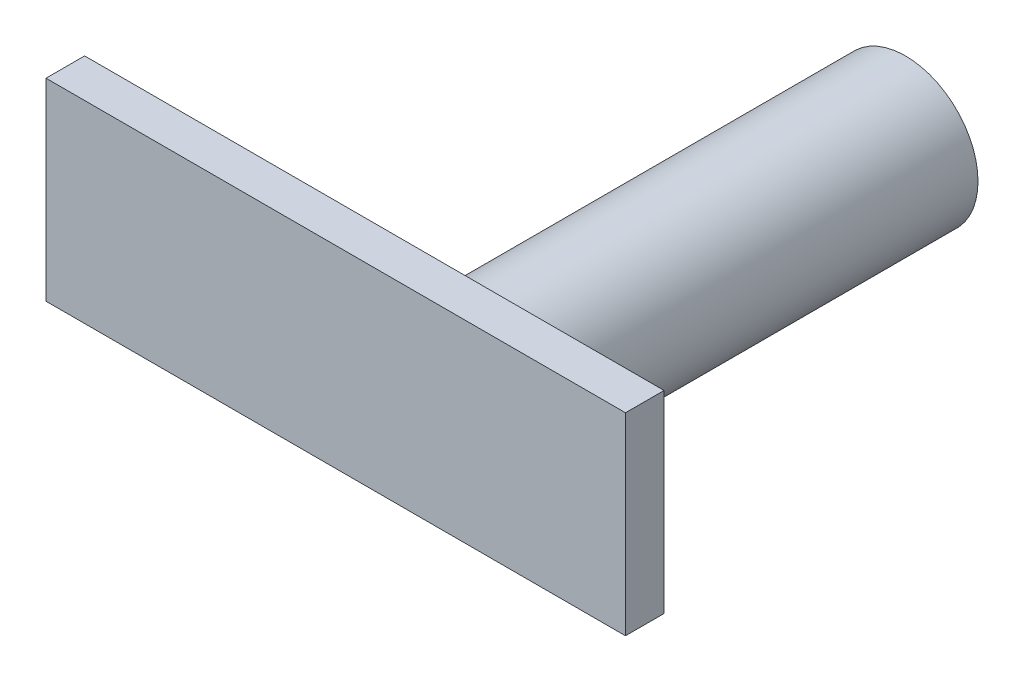
ISO-10303-21;
HEADER;
FILE_DESCRIPTION(('STEP AP214'),'2;1');
FILE_NAME('part.step','',(''),(''),'','','');
FILE_SCHEMA(('AUTOMOTIVE_DESIGN { 1 0 10303 214 1 1 1 1 }'));
ENDSEC;
DATA;
#1=APPLICATION_CONTEXT('core data for automotive mechanical design processes');
#2=APPLICATION_PROTOCOL_DEFINITION('international standard','automotive_design',2000,#1);
#3=PRODUCT_CONTEXT('',#1,'mechanical');
#4=PRODUCT('Part','Part','',(#3));
#5=PRODUCT_RELATED_PRODUCT_CATEGORY('part','',(#4));
#6=PRODUCT_DEFINITION_FORMATION('','',#4);
#7=PRODUCT_DEFINITION_CONTEXT('part definition',#1,'design');
#8=PRODUCT_DEFINITION('design','',#6,#7);
#9=PRODUCT_DEFINITION_SHAPE('','',#8);
#10=(LENGTH_UNIT() NAMED_UNIT(*) SI_UNIT(.MILLI.,.METRE.));
#11=(NAMED_UNIT(*) PLANE_ANGLE_UNIT() SI_UNIT($,.RADIAN.));
#12=(NAMED_UNIT(*) SI_UNIT($,.STERADIAN.) SOLID_ANGLE_UNIT());
#13=UNCERTAINTY_MEASURE_WITH_UNIT(LENGTH_MEASURE(1.E-05),#10,'distance_accuracy_value','');
#14=(GEOMETRIC_REPRESENTATION_CONTEXT(3) GLOBAL_UNCERTAINTY_ASSIGNED_CONTEXT((#13)) GLOBAL_UNIT_ASSIGNED_CONTEXT((#10,
#11,#12)) REPRESENTATION_CONTEXT('',''));
#15=CARTESIAN_POINT('',(0.,0.,0.));
#16=DIRECTION('',(0.,0.,1.));
#17=DIRECTION('',(1.,0.,0.));
#18=AXIS2_PLACEMENT_3D('',#15,#16,#17);
#19=CARTESIAN_POINT('',(-4.,1.,5.4));
#20=DIRECTION('',(1.,0.,0.));
#21=DIRECTION('',(0.,0.,-1.));
#22=AXIS2_PLACEMENT_3D('',#19,#20,#21);
#23=PLANE('',#22);
#24=DIRECTION('',(0.,-1.,0.));
#25=VECTOR('',#24,1.);
#26=CARTESIAN_POINT('',(-4.,1.,5.));
#27=LINE('',#26,#25);
#28=CARTESIAN_POINT('',(-4.,1.,5.));
#29=VERTEX_POINT('',#28);
#30=CARTESIAN_POINT('',(-4.,-1.,5.));
#31=VERTEX_POINT('',#30);
#32=EDGE_CURVE('E96',#29,#31,#27,.T.);
#33=ORIENTED_EDGE('',*,*,#32,.T.);
#34=DIRECTION('',(0.,0.,-1.));
#35=VECTOR('',#34,1.);
#36=CARTESIAN_POINT('',(-4.,-1.,5.4));
#37=LINE('',#36,#35);
#38=CARTESIAN_POINT('',(-4.,-1.,5.4));
#39=VERTEX_POINT('',#38);
#40=EDGE_CURVE('E11',#39,#31,#37,.T.);
#41=ORIENTED_EDGE('',*,*,#40,.F.);
#42=DIRECTION('',(0.,-1.,0.));
#43=VECTOR('',#42,1.);
#44=CARTESIAN_POINT('',(-4.,1.,5.4));
#45=LINE('',#44,#43);
#46=CARTESIAN_POINT('',(-4.,1.,5.4));
#47=VERTEX_POINT('',#46);
#48=EDGE_CURVE('E84',#47,#39,#45,.T.);
#49=ORIENTED_EDGE('',*,*,#48,.F.);
#50=DIRECTION('',(0.,0.,-1.));
#51=VECTOR('',#50,1.);
#52=CARTESIAN_POINT('',(-4.,1.,5.4));
#53=LINE('',#52,#51);
#54=EDGE_CURVE('E92',#47,#29,#53,.T.);
#55=ORIENTED_EDGE('',*,*,#54,.T.);
#56=EDGE_LOOP('',(#33,#41,#49,#55));
#57=FACE_BOUND('',#56,.T.);
#58=ADVANCED_FACE('F33',(#57),#23,.F.);
#59=CARTESIAN_POINT('',(-4.,-1.,5.4));
#60=DIRECTION('',(0.,1.,0.));
#61=DIRECTION('',(0.,0.,1.));
#62=AXIS2_PLACEMENT_3D('',#59,#60,#61);
#63=PLANE('',#62);
#64=DIRECTION('',(1.,0.,0.));
#65=VECTOR('',#64,1.);
#66=CARTESIAN_POINT('',(-4.,-1.,5.));
#67=LINE('',#66,#65);
#68=CARTESIAN_POINT('',(2.,-1.,5.));
#69=VERTEX_POINT('',#68);
#70=EDGE_CURVE('E88',#31,#69,#67,.T.);
#71=ORIENTED_EDGE('',*,*,#70,.T.);
#72=DIRECTION('',(0.,0.,-1.));
#73=VECTOR('',#72,1.);
#74=CARTESIAN_POINT('',(2.,-1.,5.4));
#75=LINE('',#74,#73);
#76=CARTESIAN_POINT('',(2.,-1.,5.4));
#77=VERTEX_POINT('',#76);
#78=EDGE_CURVE('E41',#77,#69,#75,.T.);
#79=ORIENTED_EDGE('',*,*,#78,.F.);
#80=DIRECTION('',(1.,0.,0.));
#81=VECTOR('',#80,1.);
#82=CARTESIAN_POINT('',(-4.,-1.,5.4));
#83=LINE('',#82,#81);
#84=EDGE_CURVE('E79',#39,#77,#83,.T.);
#85=ORIENTED_EDGE('',*,*,#84,.F.);
#86=ORIENTED_EDGE('',*,*,#40,.T.);
#87=EDGE_LOOP('',(#71,#79,#85,#86));
#88=FACE_BOUND('',#87,.T.);
#89=ADVANCED_FACE('F87',(#88),#63,.F.);
#90=CARTESIAN_POINT('',(2.,1.,5.4));
#91=DIRECTION('',(-1.,0.,0.));
#92=DIRECTION('',(0.,0.,1.));
#93=AXIS2_PLACEMENT_3D('',#90,#91,#92);
#94=PLANE('',#93);
#95=DIRECTION('',(0.,1.,0.));
#96=VECTOR('',#95,1.);
#97=CARTESIAN_POINT('',(2.,1.,5.));
#98=LINE('',#97,#96);
#99=CARTESIAN_POINT('',(2.,1.,5.));
#100=VERTEX_POINT('',#99);
#101=EDGE_CURVE('E66',#69,#100,#98,.T.);
#102=ORIENTED_EDGE('',*,*,#101,.T.);
#103=DIRECTION('',(0.,0.,-1.));
#104=VECTOR('',#103,1.);
#105=CARTESIAN_POINT('',(2.,1.,5.4));
#106=LINE('',#105,#104);
#107=CARTESIAN_POINT('',(2.,1.,5.4));
#108=VERTEX_POINT('',#107);
#109=EDGE_CURVE('E89',#108,#100,#106,.T.);
#110=ORIENTED_EDGE('',*,*,#109,.F.);
#111=DIRECTION('',(0.,1.,0.));
#112=VECTOR('',#111,1.);
#113=CARTESIAN_POINT('',(2.,1.,5.4));
#114=LINE('',#113,#112);
#115=EDGE_CURVE('E82',#77,#108,#114,.T.);
#116=ORIENTED_EDGE('',*,*,#115,.F.);
#117=ORIENTED_EDGE('',*,*,#78,.T.);
#118=EDGE_LOOP('',(#102,#110,#116,#117));
#119=FACE_BOUND('',#118,.T.);
#120=ADVANCED_FACE('F90',(#119),#94,.F.);
#121=CARTESIAN_POINT('',(-4.,1.,5.4));
#122=DIRECTION('',(0.,-1.,0.));
#123=DIRECTION('',(0.,0.,-1.));
#124=AXIS2_PLACEMENT_3D('',#121,#122,#123);
#125=PLANE('',#124);
#126=DIRECTION('',(-1.,0.,0.));
#127=VECTOR('',#126,1.);
#128=CARTESIAN_POINT('',(-4.,1.,5.));
#129=LINE('',#128,#127);
#130=EDGE_CURVE('E72',#100,#29,#129,.T.);
#131=ORIENTED_EDGE('',*,*,#130,.T.);
#132=ORIENTED_EDGE('',*,*,#54,.F.);
#133=DIRECTION('',(-1.,0.,0.));
#134=VECTOR('',#133,1.);
#135=CARTESIAN_POINT('',(-4.,1.,5.4));
#136=LINE('',#135,#134);
#137=EDGE_CURVE('E49',#108,#47,#136,.T.);
#138=ORIENTED_EDGE('',*,*,#137,.F.);
#139=ORIENTED_EDGE('',*,*,#109,.T.);
#140=EDGE_LOOP('',(#131,#132,#138,#139));
#141=FACE_BOUND('',#140,.T.);
#142=ADVANCED_FACE('F104',(#141),#125,.F.);
#143=CARTESIAN_POINT('',(0.,0.,5.4));
#144=DIRECTION('',(0.,0.,1.));
#145=DIRECTION('',(1.,0.,0.));
#146=AXIS2_PLACEMENT_3D('',#143,#144,#145);
#147=PLANE('',#146);
#148=ORIENTED_EDGE('',*,*,#48,.T.);
#149=ORIENTED_EDGE('',*,*,#84,.T.);
#150=ORIENTED_EDGE('',*,*,#115,.T.);
#151=ORIENTED_EDGE('',*,*,#137,.T.);
#152=EDGE_LOOP('',(#148,#149,#150,#151));
#153=FACE_BOUND('',#152,.T.);
#154=ADVANCED_FACE('F80',(#153),#147,.T.);
#155=CARTESIAN_POINT('',(0.,0.,5.));
#156=DIRECTION('',(0.,0.,1.));
#157=DIRECTION('',(1.,0.,0.));
#158=AXIS2_PLACEMENT_3D('',#155,#156,#157);
#159=PLANE('',#158);
#160=CARTESIAN_POINT('',(0.,0.,5.));
#161=DIRECTION('',(0.,0.,1.));
#162=DIRECTION('',(1.,0.,0.));
#163=AXIS2_PLACEMENT_3D('',#160,#161,#162);
#164=CIRCLE('',#163,0.75);
#165=CARTESIAN_POINT('',(0.75,0.,5.));
#166=VERTEX_POINT('',#165);
#167=EDGE_CURVE('E110',#166,#166,#164,.T.);
#168=ORIENTED_EDGE('',*,*,#167,.T.);
#169=EDGE_LOOP('',(#168));
#170=FACE_BOUND('',#169,.T.);
#171=ORIENTED_EDGE('',*,*,#32,.F.);
#172=ORIENTED_EDGE('',*,*,#130,.F.);
#173=ORIENTED_EDGE('',*,*,#101,.F.);
#174=ORIENTED_EDGE('',*,*,#70,.F.);
#175=EDGE_LOOP('',(#171,#172,#173,#174));
#176=FACE_BOUND('',#175,.T.);
#177=ADVANCED_FACE('F107',(#170,#176),#159,.F.);
#178=CARTESIAN_POINT('',(0.,0.,0.5));
#179=DIRECTION('',(0.,0.,1.));
#180=DIRECTION('',(1.,0.,0.));
#181=AXIS2_PLACEMENT_3D('',#178,#179,#180);
#182=CYLINDRICAL_SURFACE('',#181,0.75);
#183=CARTESIAN_POINT('',(0.,0.,0.5));
#184=DIRECTION('',(0.,0.,1.));
#185=DIRECTION('',(1.,0.,0.));
#186=AXIS2_PLACEMENT_3D('',#183,#184,#185);
#187=CIRCLE('',#186,0.75);
#188=CARTESIAN_POINT('',(0.75,0.,0.5));
#189=VERTEX_POINT('',#188);
#190=EDGE_CURVE('E99',#189,#189,#187,.T.);
#191=ORIENTED_EDGE('',*,*,#190,.T.);
#192=EDGE_LOOP('',(#191));
#193=FACE_BOUND('',#192,.T.);
#194=ORIENTED_EDGE('',*,*,#167,.F.);
#195=EDGE_LOOP('',(#194));
#196=FACE_BOUND('',#195,.T.);
#197=ADVANCED_FACE('F116',(#193,#196),#182,.T.);
#198=CARTESIAN_POINT('',(0.,0.,0.5));
#199=DIRECTION('',(0.,0.,1.));
#200=DIRECTION('',(1.,0.,0.));
#201=AXIS2_PLACEMENT_3D('',#198,#199,#200);
#202=PLANE('',#201);
#203=ORIENTED_EDGE('',*,*,#190,.F.);
#204=EDGE_LOOP('',(#203));
#205=FACE_BOUND('',#204,.T.);
#206=ADVANCED_FACE('F119',(#205),#202,.F.);
#207=CLOSED_SHELL('',(#58,#89,#120,#142,#154,#177,#197,#206));
#208=MANIFOLD_SOLID_BREP('B2',#207);
#209=ADVANCED_BREP_SHAPE_REPRESENTATION('',(#18,#208),#14);
#210=SHAPE_DEFINITION_REPRESENTATION(#9,#209);
ENDSEC;
END-ISO-10303-21;
